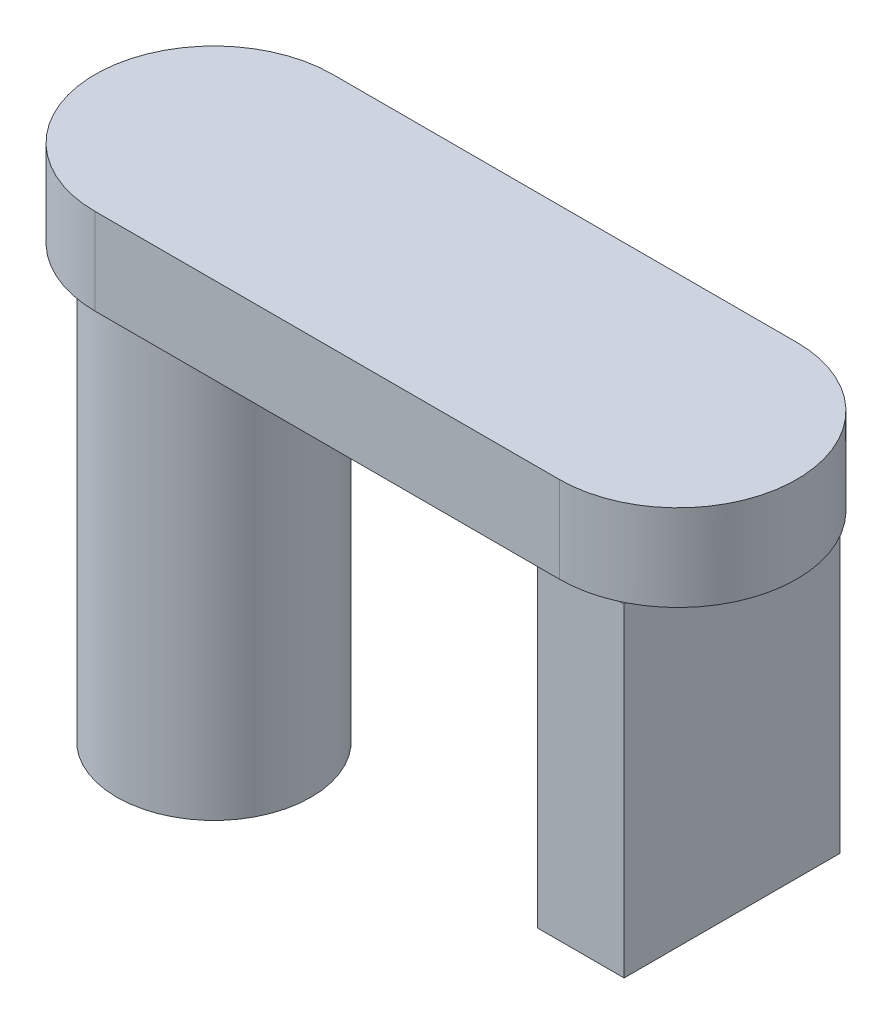
ISO-10303-21;
HEADER;
FILE_DESCRIPTION(('STEP AP214'),'2;1');
FILE_NAME('part.step','',(''),(''),'','','');
FILE_SCHEMA(('AUTOMOTIVE_DESIGN { 1 0 10303 214 1 1 1 1 }'));
ENDSEC;
DATA;
#1=APPLICATION_CONTEXT('core data for automotive mechanical design processes');
#2=APPLICATION_PROTOCOL_DEFINITION('international standard','automotive_design',2000,#1);
#3=PRODUCT_CONTEXT('',#1,'mechanical');
#4=PRODUCT('Part','Part','',(#3));
#5=PRODUCT_RELATED_PRODUCT_CATEGORY('part','',(#4));
#6=PRODUCT_DEFINITION_FORMATION('','',#4);
#7=PRODUCT_DEFINITION_CONTEXT('part definition',#1,'design');
#8=PRODUCT_DEFINITION('design','',#6,#7);
#9=PRODUCT_DEFINITION_SHAPE('','',#8);
#10=(LENGTH_UNIT() NAMED_UNIT(*) SI_UNIT(.MILLI.,.METRE.));
#11=(NAMED_UNIT(*) PLANE_ANGLE_UNIT() SI_UNIT($,.RADIAN.));
#12=(NAMED_UNIT(*) SI_UNIT($,.STERADIAN.) SOLID_ANGLE_UNIT());
#13=UNCERTAINTY_MEASURE_WITH_UNIT(LENGTH_MEASURE(1.E-05),#10,'distance_accuracy_value','');
#14=(GEOMETRIC_REPRESENTATION_CONTEXT(3) GLOBAL_UNCERTAINTY_ASSIGNED_CONTEXT((#13)) GLOBAL_UNIT_ASSIGNED_CONTEXT((#10,
#11,#12)) REPRESENTATION_CONTEXT('',''));
#15=CARTESIAN_POINT('',(0.,0.,0.));
#16=DIRECTION('',(0.,0.,1.));
#17=DIRECTION('',(1.,0.,0.));
#18=AXIS2_PLACEMENT_3D('',#15,#16,#17);
#19=CARTESIAN_POINT('',(2.4,2.,-0.499999999999999));
#20=DIRECTION('',(-1.,0.,0.));
#21=DIRECTION('',(0.,0.,1.));
#22=AXIS2_PLACEMENT_3D('',#19,#20,#21);
#23=PLANE('',#22);
#24=DIRECTION('',(0.,0.,1.));
#25=VECTOR('',#24,1.);
#26=CARTESIAN_POINT('',(2.4,0.5,0.500000000000001));
#27=LINE('',#26,#25);
#28=CARTESIAN_POINT('',(2.4,0.5,-0.499999999999999));
#29=VERTEX_POINT('',#28);
#30=CARTESIAN_POINT('',(2.4,0.5,0.500000000000001));
#31=VERTEX_POINT('',#30);
#32=EDGE_CURVE('E52',#29,#31,#27,.T.);
#33=ORIENTED_EDGE('',*,*,#32,.F.);
#34=DIRECTION('',(0.,-1.,0.));
#35=VECTOR('',#34,1.);
#36=CARTESIAN_POINT('',(2.4,2.,-0.499999999999999));
#37=LINE('',#36,#35);
#38=CARTESIAN_POINT('',(2.4,2.,-0.499999999999999));
#39=VERTEX_POINT('',#38);
#40=EDGE_CURVE('E128',#39,#29,#37,.T.);
#41=ORIENTED_EDGE('',*,*,#40,.F.);
#42=DIRECTION('',(0.,0.,-1.));
#43=VECTOR('',#42,1.);
#44=CARTESIAN_POINT('',(2.4,2.,-0.499999999999999));
#45=LINE('',#44,#43);
#46=CARTESIAN_POINT('',(2.4,2.,-0.489897948556636));
#47=VERTEX_POINT('',#46);
#48=EDGE_CURVE('E185',#47,#39,#45,.T.);
#49=ORIENTED_EDGE('',*,*,#48,.F.);
#50=DIRECTION('',(0.,0.,1.));
#51=VECTOR('',#50,1.);
#52=CARTESIAN_POINT('',(2.4,2.,0.));
#53=LINE('',#52,#51);
#54=CARTESIAN_POINT('',(2.4,2.,0.489897948556636));
#55=VERTEX_POINT('',#54);
#56=EDGE_CURVE('E11',#47,#55,#53,.T.);
#57=ORIENTED_EDGE('',*,*,#56,.T.);
#58=CARTESIAN_POINT('',(2.4,2.,0.500000000000001));
#59=VERTEX_POINT('',#58);
#60=EDGE_CURVE('E186',#59,#55,#45,.T.);
#61=ORIENTED_EDGE('',*,*,#60,.F.);
#62=DIRECTION('',(0.,-1.,0.));
#63=VECTOR('',#62,1.);
#64=CARTESIAN_POINT('',(2.4,2.,0.500000000000001));
#65=LINE('',#64,#63);
#66=EDGE_CURVE('E136',#59,#31,#65,.T.);
#67=ORIENTED_EDGE('',*,*,#66,.T.);
#68=EDGE_LOOP('',(#33,#41,#49,#57,#61,#67));
#69=FACE_BOUND('',#68,.T.);
#70=ADVANCED_FACE('F37',(#69),#23,.F.);
#71=CARTESIAN_POINT('',(2.,2.,-0.499999999999999));
#72=DIRECTION('',(0.,0.,1.));
#73=DIRECTION('',(1.,0.,0.));
#74=AXIS2_PLACEMENT_3D('',#71,#72,#73);
#75=PLANE('',#74);
#76=DIRECTION('',(1.,0.,0.));
#77=VECTOR('',#76,1.);
#78=CARTESIAN_POINT('',(2.,0.5,-0.499999999999999));
#79=LINE('',#78,#77);
#80=CARTESIAN_POINT('',(2.,0.5,-0.499999999999999));
#81=VERTEX_POINT('',#80);
#82=EDGE_CURVE('E114',#81,#29,#79,.T.);
#83=ORIENTED_EDGE('',*,*,#82,.F.);
#84=DIRECTION('',(0.,-1.,0.));
#85=VECTOR('',#84,1.);
#86=CARTESIAN_POINT('',(2.,2.,-0.499999999999999));
#87=LINE('',#86,#85);
#88=CARTESIAN_POINT('',(2.,2.,-0.499999999999999));
#89=VERTEX_POINT('',#88);
#90=EDGE_CURVE('E124',#89,#81,#87,.T.);
#91=ORIENTED_EDGE('',*,*,#90,.F.);
#92=DIRECTION('',(1.,0.,0.));
#93=VECTOR('',#92,1.);
#94=CARTESIAN_POINT('',(0.,2.,-0.499999999999999));
#95=LINE('',#94,#93);
#96=CARTESIAN_POINT('',(2.37912878474779,2.,-0.499999999999999));
#97=VERTEX_POINT('',#96);
#98=EDGE_CURVE('E45',#89,#97,#95,.T.);
#99=ORIENTED_EDGE('',*,*,#98,.T.);
#100=DIRECTION('',(-1.,0.,0.));
#101=VECTOR('',#100,1.);
#102=CARTESIAN_POINT('',(2.,2.,-0.499999999999999));
#103=LINE('',#102,#101);
#104=EDGE_CURVE('E178',#39,#97,#103,.T.);
#105=ORIENTED_EDGE('',*,*,#104,.F.);
#106=ORIENTED_EDGE('',*,*,#40,.T.);
#107=EDGE_LOOP('',(#83,#91,#99,#105,#106));
#108=FACE_BOUND('',#107,.T.);
#109=ADVANCED_FACE('F123',(#108),#75,.F.);
#110=CARTESIAN_POINT('',(2.,2.,-0.499999999999999));
#111=DIRECTION('',(1.,0.,0.));
#112=DIRECTION('',(0.,0.,-1.));
#113=AXIS2_PLACEMENT_3D('',#110,#111,#112);
#114=PLANE('',#113);
#115=DIRECTION('',(0.,0.,-1.));
#116=VECTOR('',#115,1.);
#117=CARTESIAN_POINT('',(2.,0.5,0.500000000000001));
#118=LINE('',#117,#116);
#119=CARTESIAN_POINT('',(2.,0.5,0.500000000000001));
#120=VERTEX_POINT('',#119);
#121=EDGE_CURVE('E111',#120,#81,#118,.T.);
#122=ORIENTED_EDGE('',*,*,#121,.F.);
#123=DIRECTION('',(0.,-1.,0.));
#124=VECTOR('',#123,1.);
#125=CARTESIAN_POINT('',(2.,2.,0.500000000000001));
#126=LINE('',#125,#124);
#127=CARTESIAN_POINT('',(2.,2.,0.500000000000001));
#128=VERTEX_POINT('',#127);
#129=EDGE_CURVE('E132',#128,#120,#126,.T.);
#130=ORIENTED_EDGE('',*,*,#129,.F.);
#131=DIRECTION('',(0.,0.,1.));
#132=VECTOR('',#131,1.);
#133=CARTESIAN_POINT('',(2.,2.,-0.499999999999999));
#134=LINE('',#133,#132);
#135=EDGE_CURVE('E131',#89,#128,#134,.T.);
#136=ORIENTED_EDGE('',*,*,#135,.F.);
#137=ORIENTED_EDGE('',*,*,#90,.T.);
#138=EDGE_LOOP('',(#122,#130,#136,#137));
#139=FACE_BOUND('',#138,.T.);
#140=ADVANCED_FACE('F130',(#139),#114,.F.);
#141=CARTESIAN_POINT('',(2.,2.,0.500000000000001));
#142=DIRECTION('',(0.,0.,-1.));
#143=DIRECTION('',(-1.,0.,0.));
#144=AXIS2_PLACEMENT_3D('',#141,#142,#143);
#145=PLANE('',#144);
#146=DIRECTION('',(-1.,0.,0.));
#147=VECTOR('',#146,1.);
#148=CARTESIAN_POINT('',(2.,0.5,0.500000000000001));
#149=LINE('',#148,#147);
#150=EDGE_CURVE('E115',#31,#120,#149,.T.);
#151=ORIENTED_EDGE('',*,*,#150,.F.);
#152=ORIENTED_EDGE('',*,*,#66,.F.);
#153=DIRECTION('',(1.,0.,0.));
#154=VECTOR('',#153,1.);
#155=CARTESIAN_POINT('',(2.,2.,0.500000000000001));
#156=LINE('',#155,#154);
#157=CARTESIAN_POINT('',(2.37912878474779,2.,0.500000000000001));
#158=VERTEX_POINT('',#157);
#159=EDGE_CURVE('E188',#158,#59,#156,.T.);
#160=ORIENTED_EDGE('',*,*,#159,.F.);
#161=EDGE_CURVE('E194',#128,#158,#156,.T.);
#162=ORIENTED_EDGE('',*,*,#161,.F.);
#163=ORIENTED_EDGE('',*,*,#129,.T.);
#164=EDGE_LOOP('',(#151,#152,#160,#162,#163));
#165=FACE_BOUND('',#164,.T.);
#166=ADVANCED_FACE('F201',(#165),#145,.F.);
#167=CARTESIAN_POINT('',(0.,2.,0.));
#168=DIRECTION('',(0.,1.,0.));
#169=DIRECTION('',(0.,0.,1.));
#170=AXIS2_PLACEMENT_3D('',#167,#168,#169);
#171=PLANE('',#170);
#172=ORIENTED_EDGE('',*,*,#56,.F.);
#173=CARTESIAN_POINT('',(2.15,2.,0.));
#174=DIRECTION('',(0.,1.,0.));
#175=DIRECTION('',(0.,0.,1.));
#176=AXIS2_PLACEMENT_3D('',#173,#174,#175);
#177=CIRCLE('',#176,0.55);
#178=EDGE_CURVE('E215',#55,#47,#177,.T.);
#179=ORIENTED_EDGE('',*,*,#178,.F.);
#180=EDGE_LOOP('',(#172,#179));
#181=FACE_BOUND('',#180,.T.);
#182=ADVANCED_FACE('F251',(#181),#171,.F.);
#183=CARTESIAN_POINT('',(0.,2.,0.));
#184=DIRECTION('',(0.,1.,0.));
#185=DIRECTION('',(0.,0.,1.));
#186=AXIS2_PLACEMENT_3D('',#183,#184,#185);
#187=CIRCLE('',#186,0.45);
#188=CARTESIAN_POINT('',(0.,2.,0.45));
#189=VERTEX_POINT('',#188);
#190=EDGE_CURVE('E173',#189,#189,#187,.T.);
#191=ORIENTED_EDGE('',*,*,#190,.T.);
#192=EDGE_LOOP('',(#191));
#193=FACE_BOUND('',#192,.T.);
#194=ORIENTED_EDGE('',*,*,#98,.F.);
#195=ORIENTED_EDGE('',*,*,#135,.T.);
#196=ORIENTED_EDGE('',*,*,#161,.T.);
#197=CARTESIAN_POINT('',(2.15,2.,0.55));
#198=VERTEX_POINT('',#197);
#199=EDGE_CURVE('E156',#198,#158,#177,.T.);
#200=ORIENTED_EDGE('',*,*,#199,.F.);
#201=DIRECTION('',(1.,0.,0.));
#202=VECTOR('',#201,1.);
#203=CARTESIAN_POINT('',(0.,2.,0.55));
#204=LINE('',#203,#202);
#205=CARTESIAN_POINT('',(0.,2.,0.55));
#206=VERTEX_POINT('',#205);
#207=EDGE_CURVE('E153',#206,#198,#204,.T.);
#208=ORIENTED_EDGE('',*,*,#207,.F.);
#209=CARTESIAN_POINT('',(0.,2.,0.));
#210=DIRECTION('',(0.,1.,0.));
#211=DIRECTION('',(0.,0.,1.));
#212=AXIS2_PLACEMENT_3D('',#209,#210,#211);
#213=CIRCLE('',#212,0.55);
#214=CARTESIAN_POINT('',(0.,2.,-0.55));
#215=VERTEX_POINT('',#214);
#216=EDGE_CURVE('E134',#215,#206,#213,.T.);
#217=ORIENTED_EDGE('',*,*,#216,.F.);
#218=DIRECTION('',(-1.,0.,0.));
#219=VECTOR('',#218,1.);
#220=CARTESIAN_POINT('',(0.,2.,-0.55));
#221=LINE('',#220,#219);
#222=CARTESIAN_POINT('',(2.15,2.,-0.55));
#223=VERTEX_POINT('',#222);
#224=EDGE_CURVE('E144',#223,#215,#221,.T.);
#225=ORIENTED_EDGE('',*,*,#224,.F.);
#226=EDGE_CURVE('E155',#97,#223,#177,.T.);
#227=ORIENTED_EDGE('',*,*,#226,.F.);
#228=EDGE_LOOP('',(#194,#195,#196,#200,#208,#217,#225,#227));
#229=FACE_BOUND('',#228,.T.);
#230=ADVANCED_FACE('F205',(#193,#229),#171,.F.);
#231=CARTESIAN_POINT('',(0.,2.,0.));
#232=DIRECTION('',(0.,-1.,0.));
#233=DIRECTION('',(0.,0.,-1.));
#234=AXIS2_PLACEMENT_3D('',#231,#232,#233);
#235=CYLINDRICAL_SURFACE('',#234,0.45);
#236=ORIENTED_EDGE('',*,*,#190,.F.);
#237=EDGE_LOOP('',(#236));
#238=FACE_BOUND('',#237,.T.);
#239=CARTESIAN_POINT('',(0.,0.,0.));
#240=DIRECTION('',(0.,1.,0.));
#241=DIRECTION('',(0.,0.,1.));
#242=AXIS2_PLACEMENT_3D('',#239,#240,#241);
#243=CIRCLE('',#242,0.45);
#244=CARTESIAN_POINT('',(0.,0.,0.45));
#245=VERTEX_POINT('',#244);
#246=EDGE_CURVE('E172',#245,#245,#243,.T.);
#247=ORIENTED_EDGE('',*,*,#246,.T.);
#248=EDGE_LOOP('',(#247));
#249=FACE_BOUND('',#248,.T.);
#250=ADVANCED_FACE('F39',(#238,#249),#235,.T.);
#251=CARTESIAN_POINT('',(0.,0.,0.));
#252=DIRECTION('',(0.,1.,0.));
#253=DIRECTION('',(0.,0.,1.));
#254=AXIS2_PLACEMENT_3D('',#251,#252,#253);
#255=PLANE('',#254);
#256=ORIENTED_EDGE('',*,*,#246,.F.);
#257=EDGE_LOOP('',(#256));
#258=FACE_BOUND('',#257,.T.);
#259=ADVANCED_FACE('F238',(#258),#255,.F.);
#260=CARTESIAN_POINT('',(0.,2.4,0.));
#261=DIRECTION('',(0.,-1.,0.));
#262=DIRECTION('',(0.,0.,-1.));
#263=AXIS2_PLACEMENT_3D('',#260,#261,#262);
#264=CYLINDRICAL_SURFACE('',#263,0.55);
#265=ORIENTED_EDGE('',*,*,#216,.T.);
#266=DIRECTION('',(0.,-1.,0.));
#267=VECTOR('',#266,1.);
#268=CARTESIAN_POINT('',(0.,2.4,0.55));
#269=LINE('',#268,#267);
#270=CARTESIAN_POINT('',(0.,2.4,0.55));
#271=VERTEX_POINT('',#270);
#272=EDGE_CURVE('E169',#271,#206,#269,.T.);
#273=ORIENTED_EDGE('',*,*,#272,.F.);
#274=CARTESIAN_POINT('',(0.,2.4,0.));
#275=DIRECTION('',(0.,1.,0.));
#276=DIRECTION('',(0.,0.,1.));
#277=AXIS2_PLACEMENT_3D('',#274,#275,#276);
#278=CIRCLE('',#277,0.55);
#279=CARTESIAN_POINT('',(0.,2.4,-0.55));
#280=VERTEX_POINT('',#279);
#281=EDGE_CURVE('E140',#280,#271,#278,.T.);
#282=ORIENTED_EDGE('',*,*,#281,.F.);
#283=DIRECTION('',(0.,-1.,0.));
#284=VECTOR('',#283,1.);
#285=CARTESIAN_POINT('',(0.,2.4,-0.55));
#286=LINE('',#285,#284);
#287=EDGE_CURVE('E150',#280,#215,#286,.T.);
#288=ORIENTED_EDGE('',*,*,#287,.T.);
#289=EDGE_LOOP('',(#265,#273,#282,#288));
#290=FACE_BOUND('',#289,.T.);
#291=ADVANCED_FACE('F225',(#290),#264,.T.);
#292=CARTESIAN_POINT('',(0.,2.4,0.55));
#293=DIRECTION('',(0.,0.,-1.));
#294=DIRECTION('',(-1.,0.,0.));
#295=AXIS2_PLACEMENT_3D('',#292,#293,#294);
#296=PLANE('',#295);
#297=ORIENTED_EDGE('',*,*,#207,.T.);
#298=DIRECTION('',(0.,-1.,0.));
#299=VECTOR('',#298,1.);
#300=CARTESIAN_POINT('',(2.15,2.4,0.55));
#301=LINE('',#300,#299);
#302=CARTESIAN_POINT('',(2.15,2.4,0.55));
#303=VERTEX_POINT('',#302);
#304=EDGE_CURVE('E166',#303,#198,#301,.T.);
#305=ORIENTED_EDGE('',*,*,#304,.F.);
#306=DIRECTION('',(1.,0.,0.));
#307=VECTOR('',#306,1.);
#308=CARTESIAN_POINT('',(0.,2.4,0.55));
#309=LINE('',#308,#307);
#310=EDGE_CURVE('E143',#271,#303,#309,.T.);
#311=ORIENTED_EDGE('',*,*,#310,.F.);
#312=ORIENTED_EDGE('',*,*,#272,.T.);
#313=EDGE_LOOP('',(#297,#305,#311,#312));
#314=FACE_BOUND('',#313,.T.);
#315=ADVANCED_FACE('F230',(#314),#296,.F.);
#316=CARTESIAN_POINT('',(2.15,2.4,0.));
#317=DIRECTION('',(0.,-1.,0.));
#318=DIRECTION('',(0.,0.,-1.));
#319=AXIS2_PLACEMENT_3D('',#316,#317,#318);
#320=CYLINDRICAL_SURFACE('',#319,0.55);
#321=ORIENTED_EDGE('',*,*,#199,.T.);
#322=EDGE_CURVE('E159',#158,#55,#177,.T.);
#323=ORIENTED_EDGE('',*,*,#322,.T.);
#324=ORIENTED_EDGE('',*,*,#178,.T.);
#325=EDGE_CURVE('E183',#47,#97,#177,.T.);
#326=ORIENTED_EDGE('',*,*,#325,.T.);
#327=ORIENTED_EDGE('',*,*,#226,.T.);
#328=DIRECTION('',(0.,-1.,0.));
#329=VECTOR('',#328,1.);
#330=CARTESIAN_POINT('',(2.15,2.4,-0.55));
#331=LINE('',#330,#329);
#332=CARTESIAN_POINT('',(2.15,2.4,-0.55));
#333=VERTEX_POINT('',#332);
#334=EDGE_CURVE('E163',#333,#223,#331,.T.);
#335=ORIENTED_EDGE('',*,*,#334,.F.);
#336=CARTESIAN_POINT('',(2.15,2.4,0.));
#337=DIRECTION('',(0.,1.,0.));
#338=DIRECTION('',(0.,0.,1.));
#339=AXIS2_PLACEMENT_3D('',#336,#337,#338);
#340=CIRCLE('',#339,0.55);
#341=EDGE_CURVE('E146',#303,#333,#340,.T.);
#342=ORIENTED_EDGE('',*,*,#341,.F.);
#343=ORIENTED_EDGE('',*,*,#304,.T.);
#344=EDGE_LOOP('',(#321,#323,#324,#326,#327,#335,#342,#343));
#345=FACE_BOUND('',#344,.T.);
#346=ADVANCED_FACE('F209',(#345),#320,.T.);
#347=CARTESIAN_POINT('',(0.,2.4,-0.55));
#348=DIRECTION('',(0.,0.,1.));
#349=DIRECTION('',(1.,0.,0.));
#350=AXIS2_PLACEMENT_3D('',#347,#348,#349);
#351=PLANE('',#350);
#352=ORIENTED_EDGE('',*,*,#224,.T.);
#353=ORIENTED_EDGE('',*,*,#287,.F.);
#354=DIRECTION('',(-1.,0.,0.));
#355=VECTOR('',#354,1.);
#356=CARTESIAN_POINT('',(0.,2.4,-0.55));
#357=LINE('',#356,#355);
#358=EDGE_CURVE('E148',#333,#280,#357,.T.);
#359=ORIENTED_EDGE('',*,*,#358,.F.);
#360=ORIENTED_EDGE('',*,*,#334,.T.);
#361=EDGE_LOOP('',(#352,#353,#359,#360));
#362=FACE_BOUND('',#361,.T.);
#363=ADVANCED_FACE('F220',(#362),#351,.F.);
#364=CARTESIAN_POINT('',(0.,2.4,0.));
#365=DIRECTION('',(0.,1.,0.));
#366=DIRECTION('',(0.,0.,1.));
#367=AXIS2_PLACEMENT_3D('',#364,#365,#366);
#368=PLANE('',#367);
#369=ORIENTED_EDGE('',*,*,#281,.T.);
#370=ORIENTED_EDGE('',*,*,#310,.T.);
#371=ORIENTED_EDGE('',*,*,#341,.T.);
#372=ORIENTED_EDGE('',*,*,#358,.T.);
#373=EDGE_LOOP('',(#369,#370,#371,#372));
#374=FACE_BOUND('',#373,.T.);
#375=ADVANCED_FACE('F228',(#374),#368,.T.);
#376=CARTESIAN_POINT('',(0.,2.,0.));
#377=DIRECTION('',(0.,1.,0.));
#378=DIRECTION('',(0.,0.,1.));
#379=AXIS2_PLACEMENT_3D('',#376,#377,#378);
#380=PLANE('',#379);
#381=ORIENTED_EDGE('',*,*,#322,.F.);
#382=ORIENTED_EDGE('',*,*,#159,.T.);
#383=ORIENTED_EDGE('',*,*,#60,.T.);
#384=EDGE_LOOP('',(#381,#382,#383));
#385=FACE_BOUND('',#384,.T.);
#386=ADVANCED_FACE('F214',(#385),#380,.T.);
#387=ORIENTED_EDGE('',*,*,#325,.F.);
#388=ORIENTED_EDGE('',*,*,#48,.T.);
#389=ORIENTED_EDGE('',*,*,#104,.T.);
#390=EDGE_LOOP('',(#387,#388,#389));
#391=FACE_BOUND('',#390,.T.);
#392=ADVANCED_FACE('F181',(#391),#380,.T.);
#393=CARTESIAN_POINT('',(0.,0.5,0.));
#394=DIRECTION('',(0.,-1.,0.));
#395=DIRECTION('',(0.,0.,-1.));
#396=AXIS2_PLACEMENT_3D('',#393,#394,#395);
#397=PLANE('',#396);
#398=ORIENTED_EDGE('',*,*,#121,.T.);
#399=ORIENTED_EDGE('',*,*,#82,.T.);
#400=ORIENTED_EDGE('',*,*,#32,.T.);
#401=ORIENTED_EDGE('',*,*,#150,.T.);
#402=EDGE_LOOP('',(#398,#399,#400,#401));
#403=FACE_BOUND('',#402,.T.);
#404=ADVANCED_FACE('F113',(#403),#397,.T.);
#405=CLOSED_SHELL('',(#70,#109,#140,#166,#182,#230,#250,#259,#291,#315,#346,#363,#375,#386,#392,#404));
#406=MANIFOLD_SOLID_BREP('B2',#405);
#407=ADVANCED_BREP_SHAPE_REPRESENTATION('',(#18,#406),#14);
#408=SHAPE_DEFINITION_REPRESENTATION(#9,#407);
ENDSEC;
END-ISO-10303-21;
